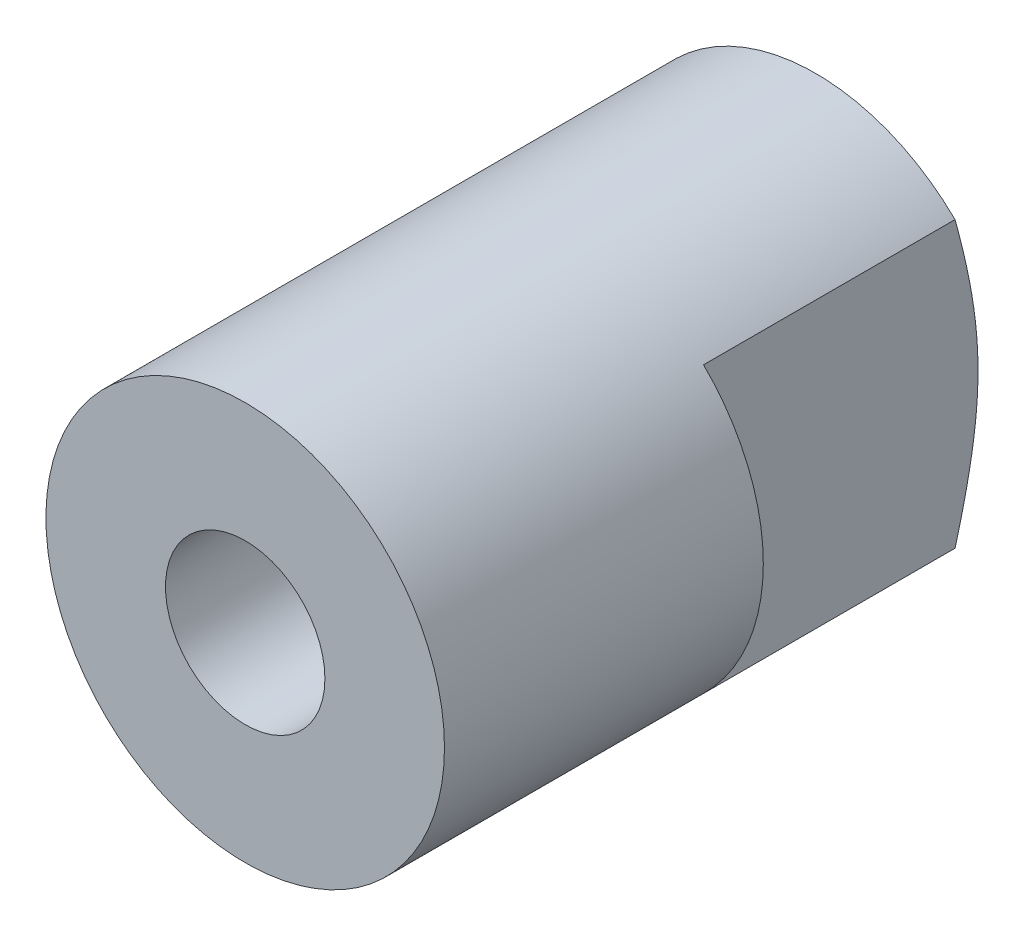
ISO-10303-21;
HEADER;
FILE_DESCRIPTION(('STEP AP214'),'2;1');
FILE_NAME('part.step','',(''),(''),'','','');
FILE_SCHEMA(('AUTOMOTIVE_DESIGN { 1 0 10303 214 1 1 1 1 }'));
ENDSEC;
DATA;
#1=APPLICATION_CONTEXT('core data for automotive mechanical design processes');
#2=APPLICATION_PROTOCOL_DEFINITION('international standard','automotive_design',2000,#1);
#3=PRODUCT_CONTEXT('',#1,'mechanical');
#4=PRODUCT('Part','Part','',(#3));
#5=PRODUCT_RELATED_PRODUCT_CATEGORY('part','',(#4));
#6=PRODUCT_DEFINITION_FORMATION('','',#4);
#7=PRODUCT_DEFINITION_CONTEXT('part definition',#1,'design');
#8=PRODUCT_DEFINITION('design','',#6,#7);
#9=PRODUCT_DEFINITION_SHAPE('','',#8);
#10=(LENGTH_UNIT() NAMED_UNIT(*) SI_UNIT(.MILLI.,.METRE.));
#11=(NAMED_UNIT(*) PLANE_ANGLE_UNIT() SI_UNIT($,.RADIAN.));
#12=(NAMED_UNIT(*) SI_UNIT($,.STERADIAN.) SOLID_ANGLE_UNIT());
#13=UNCERTAINTY_MEASURE_WITH_UNIT(LENGTH_MEASURE(1.E-05),#10,'distance_accuracy_value','');
#14=(GEOMETRIC_REPRESENTATION_CONTEXT(3) GLOBAL_UNCERTAINTY_ASSIGNED_CONTEXT((#13)) GLOBAL_UNIT_ASSIGNED_CONTEXT((#10,
#11,#12)) REPRESENTATION_CONTEXT('',''));
#15=CARTESIAN_POINT('',(0.,0.,0.));
#16=DIRECTION('',(0.,0.,1.));
#17=DIRECTION('',(1.,0.,0.));
#18=AXIS2_PLACEMENT_3D('',#15,#16,#17);
#19=CARTESIAN_POINT('',(0.,0.,8.));
#20=DIRECTION('',(0.,0.,-1.));
#21=DIRECTION('',(-1.,0.,0.));
#22=AXIS2_PLACEMENT_3D('',#19,#20,#21);
#23=CYLINDRICAL_SURFACE('',#22,2.5);
#24=CARTESIAN_POINT('',(0.,0.,8.));
#25=DIRECTION('',(0.,0.,1.));
#26=DIRECTION('',(1.,0.,0.));
#27=AXIS2_PLACEMENT_3D('',#24,#25,#26);
#28=CIRCLE('',#27,2.5);
#29=CARTESIAN_POINT('',(2.5,0.,8.));
#30=VERTEX_POINT('',#29);
#31=EDGE_CURVE('E98',#30,#30,#28,.T.);
#32=ORIENTED_EDGE('',*,*,#31,.F.);
#33=EDGE_LOOP('',(#32));
#34=FACE_BOUND('',#33,.T.);
#35=CARTESIAN_POINT('',(0.,0.,4.));
#36=DIRECTION('',(0.,0.,1.));
#37=DIRECTION('',(1.,0.,0.));
#38=AXIS2_PLACEMENT_3D('',#35,#36,#37);
#39=CIRCLE('',#38,2.5);
#40=CARTESIAN_POINT('',(-1.75,1.78535710713571,4.));
#41=VERTEX_POINT('',#40);
#42=CARTESIAN_POINT('',(-1.75,-1.78535710713571,4.));
#43=VERTEX_POINT('',#42);
#44=EDGE_CURVE('E11',#41,#43,#39,.T.);
#45=ORIENTED_EDGE('',*,*,#44,.T.);
#46=DIRECTION('',(0.,0.,-1.));
#47=VECTOR('',#46,1.);
#48=CARTESIAN_POINT('',(-1.75,-1.78535710713571,8.));
#49=LINE('',#48,#47);
#50=CARTESIAN_POINT('',(-1.75,-1.78535710713572,0.844500877077913));
#51=VERTEX_POINT('',#50);
#52=EDGE_CURVE('E78',#43,#51,#49,.T.);
#53=ORIENTED_EDGE('',*,*,#52,.T.);
#54=CARTESIAN_POINT('',(0.,0.,0.844500877077915));
#55=DIRECTION('',(0.,0.,1.));
#56=DIRECTION('',(1.,0.,0.));
#57=AXIS2_PLACEMENT_3D('',#54,#55,#56);
#58=CIRCLE('',#57,2.5);
#59=CARTESIAN_POINT('',(1.75,-1.78535710713571,0.844500877077915));
#60=VERTEX_POINT('',#59);
#61=EDGE_CURVE('E55',#51,#60,#58,.T.);
#62=ORIENTED_EDGE('',*,*,#61,.T.);
#63=DIRECTION('',(0.,0.,-1.));
#64=VECTOR('',#63,1.);
#65=CARTESIAN_POINT('',(1.75,-1.78535710713571,8.));
#66=LINE('',#65,#64);
#67=CARTESIAN_POINT('',(1.75,-1.78535710713571,4.));
#68=VERTEX_POINT('',#67);
#69=EDGE_CURVE('E93',#68,#60,#66,.T.);
#70=ORIENTED_EDGE('',*,*,#69,.F.);
#71=CARTESIAN_POINT('',(0.,0.,4.));
#72=DIRECTION('',(0.,0.,-1.));
#73=DIRECTION('',(-1.,0.,0.));
#74=AXIS2_PLACEMENT_3D('',#71,#72,#73);
#75=CIRCLE('',#74,2.5);
#76=CARTESIAN_POINT('',(1.75,1.78535710713571,4.));
#77=VERTEX_POINT('',#76);
#78=EDGE_CURVE('E112',#77,#68,#75,.T.);
#79=ORIENTED_EDGE('',*,*,#78,.F.);
#80=DIRECTION('',(0.,0.,-1.));
#81=VECTOR('',#80,1.);
#82=CARTESIAN_POINT('',(1.75,1.78535710713571,8.));
#83=LINE('',#82,#81);
#84=CARTESIAN_POINT('',(1.75,1.78535710713576,0.844500877077879));
#85=VERTEX_POINT('',#84);
#86=EDGE_CURVE('E91',#85,#77,#83,.F.);
#87=ORIENTED_EDGE('',*,*,#86,.F.);
#88=CARTESIAN_POINT('',(-1.75,1.78535710713571,0.844500877077915));
#89=VERTEX_POINT('',#88);
#90=EDGE_CURVE('E83',#85,#89,#58,.T.);
#91=ORIENTED_EDGE('',*,*,#90,.T.);
#92=DIRECTION('',(0.,0.,-1.));
#93=VECTOR('',#92,1.);
#94=CARTESIAN_POINT('',(-1.75,1.78535710713571,8.));
#95=LINE('',#94,#93);
#96=EDGE_CURVE('E47',#89,#41,#95,.F.);
#97=ORIENTED_EDGE('',*,*,#96,.T.);
#98=EDGE_LOOP('',(#45,#53,#62,#70,#79,#87,#91,#97));
#99=FACE_BOUND('',#98,.T.);
#100=ADVANCED_FACE('F30',(#34,#99),#23,.T.);
#101=CARTESIAN_POINT('',(0.,0.,0.844500877077915));
#102=DIRECTION('',(0.,0.,1.));
#103=DIRECTION('',(1.,0.,0.));
#104=AXIS2_PLACEMENT_3D('',#101,#102,#103);
#105=CONICAL_SURFACE('',#104,2.5,1.20427718387609);
#106=CARTESIAN_POINT('',(-1.75,8.19605461493812,3.10192855411082));
#107=CARTESIAN_POINT('',(-1.75,7.93002659032958,3.00207343866155));
#108=CARTESIAN_POINT('',(-1.75,7.66393629305582,2.90238339557051));
#109=CARTESIAN_POINT('',(-1.75,7.13152909729154,2.70349350215407));
#110=CARTESIAN_POINT('',(-1.75,6.86521217175532,2.60429372425121));
#111=CARTESIAN_POINT('',(-1.75,6.33137193220659,2.40621918190581));
#112=CARTESIAN_POINT('',(-1.75,6.0638477130899,2.30734685319689));
#113=CARTESIAN_POINT('',(-1.75,5.52847108782494,2.11060731775616));
#114=CARTESIAN_POINT('',(-1.75,5.26061873113467,2.01273997645805));
#115=CARTESIAN_POINT('',(-1.75,4.69243546413088,1.80690067912252));
#116=CARTESIAN_POINT('',(-1.75,4.3920370562749,1.69911402578876));
#117=CARTESIAN_POINT('',(-1.75,3.94053716748491,1.53977564660928));
#118=CARTESIAN_POINT('',(-1.75,3.78985341019414,1.48704172036875));
#119=CARTESIAN_POINT('',(-1.75,3.48811247809058,1.38265478018666));
#120=CARTESIAN_POINT('',(-1.75,3.33705530662285,1.33100175660126));
#121=CARTESIAN_POINT('',(-1.75,3.03465902882795,1.22926162315679));
#122=CARTESIAN_POINT('',(-1.75,2.88332065846902,1.1791723325718));
#123=CARTESIAN_POINT('',(-1.75,2.57996011632761,1.08111651420444));
#124=CARTESIAN_POINT('',(-1.75,2.42793797405638,1.03314989575896));
#125=CARTESIAN_POINT('',(-1.75,2.1230417120149,0.940373174383529));
#126=CARTESIAN_POINT('',(-1.75,1.97016824885314,0.895560926876658));
#127=CARTESIAN_POINT('',(-1.75,1.66312300043827,0.810668307000652));
#128=CARTESIAN_POINT('',(-1.75,1.5089515654266,0.770586699366417));
#129=CARTESIAN_POINT('',(-1.75,1.27053115325247,0.714595002701888));
#130=CARTESIAN_POINT('',(-1.75,1.18689838143284,0.696075230048017));
#131=CARTESIAN_POINT('',(-1.75,1.01907188491476,0.661723112830771));
#132=CARTESIAN_POINT('',(-1.75,0.934878135532067,0.645890887347907));
#133=CARTESIAN_POINT('',(-1.75,0.766055995920599,0.617568219562072));
#134=CARTESIAN_POINT('',(-1.75,0.681428479661771,0.605072644996745));
#135=CARTESIAN_POINT('',(-1.75,0.511676932068023,0.584049719628205));
#136=CARTESIAN_POINT('',(-1.75,0.426552928809744,0.575522146593431));
#137=CARTESIAN_POINT('',(-1.75,0.257448110399603,0.563099262363324));
#138=CARTESIAN_POINT('',(-1.75,0.173473141587534,0.559126013514574));
#139=CARTESIAN_POINT('',(-1.75,0.00543043052206547,0.555833705929554));
#140=CARTESIAN_POINT('',(-1.75,-0.0786373108317869,0.556514602455115));
#141=CARTESIAN_POINT('',(-1.75,-0.2466606186409,0.562481479130557));
#142=CARTESIAN_POINT('',(-1.75,-0.330616074370712,0.567770499785406));
#143=CARTESIAN_POINT('',(-1.75,-0.498143131702865,0.582586387763705));
#144=CARTESIAN_POINT('',(-1.75,-0.581714741236559,0.592113167121393));
#145=CARTESIAN_POINT('',(-1.75,-0.733132373175893,0.612759165314285));
#146=CARTESIAN_POINT('',(-1.75,-0.801063339165914,0.623269941698058));
#147=CARTESIAN_POINT('',(-1.75,-0.936531411412895,0.646393718582816));
#148=CARTESIAN_POINT('',(-1.75,-1.00406868675859,0.659005735236718));
#149=CARTESIAN_POINT('',(-1.75,-1.13907398495213,0.686065274942139));
#150=CARTESIAN_POINT('',(-1.75,-1.20654045799342,0.700520466121927));
#151=CARTESIAN_POINT('',(-1.75,-1.34114115039655,0.730928054015534));
#152=CARTESIAN_POINT('',(-1.75,-1.40827533017202,0.746880624799369));
#153=CARTESIAN_POINT('',(-1.75,-1.57124831227679,0.787200617761591));
#154=CARTESIAN_POINT('',(-1.75,-1.66692542789498,0.812220029330767));
#155=CARTESIAN_POINT('',(-1.75,-1.85775247370759,0.864201744609191));
#156=CARTESIAN_POINT('',(-1.75,-1.95290236634811,0.891164184851498));
#157=CARTESIAN_POINT('',(-1.75,-2.2377385603586,0.974272015785972));
#158=CARTESIAN_POINT('',(-1.75,-2.42677747428829,1.03262915689346));
#159=CARTESIAN_POINT('',(-1.75,-2.80352246290483,1.15283652769847));
#160=CARTESIAN_POINT('',(-1.75,-2.99122964359447,1.21468334766389));
#161=CARTESIAN_POINT('',(-1.75,-3.36584552392699,1.34065604438694));
#162=CARTESIAN_POINT('',(-1.75,-3.55275433460734,1.40478159183688));
#163=CARTESIAN_POINT('',(-1.75,-3.92377916807999,1.53377959369548));
#164=CARTESIAN_POINT('',(-1.75,-4.10790162296496,1.59863362812462));
#165=CARTESIAN_POINT('',(-1.75,-4.47577214599397,1.72939623513691));
#166=CARTESIAN_POINT('',(-1.75,-4.65952021221368,1.79530481312496));
#167=CARTESIAN_POINT('',(-1.75,-5.21036552649943,1.99416033981976));
#168=CARTESIAN_POINT('',(-1.75,-5.57705546474737,2.12823411737116));
#169=CARTESIAN_POINT('',(-1.75,-6.30986616663053,2.39809297791219));
#170=CARTESIAN_POINT('',(-1.75,-6.67598683473145,2.53387831926635));
#171=CARTESIAN_POINT('',(-1.75,-7.40782604147663,2.80651274381964));
#172=CARTESIAN_POINT('',(-1.75,-7.7735445855157,2.9433618125443));
#173=CARTESIAN_POINT('',(-1.75,-8.50327989620133,3.21722382699157));
#174=CARTESIAN_POINT('',(-1.75,-8.86729769985685,3.35423401242699));
#175=CARTESIAN_POINT('',(-1.75,-9.59515112634909,3.62874221697353));
#176=CARTESIAN_POINT('',(-1.75,-9.95898674836221,3.76624023826768));
#177=CARTESIAN_POINT('',(-1.75,-10.6864305795537,4.04155108727704));
#178=CARTESIAN_POINT('',(-1.75,-11.0500388232724,4.17936382376389));
#179=CARTESIAN_POINT('',(-1.75,-11.777152057885,4.45525555884364));
#180=CARTESIAN_POINT('',(-1.75,-12.1406570493235,4.59333455600137));
#181=CARTESIAN_POINT('',(-1.75,-12.5041270848073,4.73150533152928));
#182=B_SPLINE_CURVE_WITH_KNOTS('',3,(#106,#107,#108,#109,#110,#111,#112,#113,#114,#115,#116,
#117,#118,#119,#120,#121,#122,#123,#124,#125,#126,#127,#128,#129,#130,#131,#132,#133,#134,#135,
#136,#137,#138,#139,#140,#141,#142,#143,#144,#145,#146,#147,#148,#149,#150,#151,#152,#153,#154,
#155,#156,#157,#158,#159,#160,#161,#162,#163,#164,#165,#166,#167,#168,#169,#170,#171,#172,#173,
#174,#175,#176,#177,#178,#179,#180,#181),.UNSPECIFIED.,.F.,.F.,(4,2,2,2,2,2,2,2,2,2,2,2,2,2,2,2,
2,2,2,2,2,2,2,2,2,2,2,2,2,2,2,2,2,2,2,2,2,4),(0.,0.852454220552918,1.70503081270516,
2.56066028897112,3.41617366338804,4.3736131747832,4.85254475358505,5.33147205752065,
5.80969857210265,6.28790464102631,6.76578238514958,7.24353506842087,7.50047769748943,
7.75743170826617,8.0139881789128,8.27053027914937,8.52261339256092,8.77469408281637,
9.02694122551693,9.2791831324127,9.48536497652188,9.69145055165907,9.89842332663478,
10.1054201920145,10.4020738946689,10.6987484629985,11.2922025957381,11.8850865869688,
12.4778852439282,13.0635126402545,13.6491430390835,14.8204306304042,15.9918971996542,
17.163347856196,18.3301922262532,19.4970418244539,20.6635877885952,21.8301274824123),.UNSPECIFIED.);
#183=EDGE_CURVE('E40',#89,#51,#182,.T.);
#184=ORIENTED_EDGE('',*,*,#183,.F.);
#185=ORIENTED_EDGE('',*,*,#90,.F.);
#186=CARTESIAN_POINT('',(1.75,8.19605461493812,3.10192855411082));
#187=CARTESIAN_POINT('',(1.75,7.93002659032958,3.00207343866155));
#188=CARTESIAN_POINT('',(1.75,7.66393629305582,2.90238339557051));
#189=CARTESIAN_POINT('',(1.75,7.13152909729154,2.70349350215407));
#190=CARTESIAN_POINT('',(1.75,6.86521217175532,2.60429372425121));
#191=CARTESIAN_POINT('',(1.75,6.33137193220659,2.40621918190581));
#192=CARTESIAN_POINT('',(1.75,6.0638477130899,2.30734685319689));
#193=CARTESIAN_POINT('',(1.75,5.52847108782494,2.11060731775616));
#194=CARTESIAN_POINT('',(1.75,5.26061873113467,2.01273997645805));
#195=CARTESIAN_POINT('',(1.75,4.69243546413088,1.80690067912252));
#196=CARTESIAN_POINT('',(1.75,4.3920370562749,1.69911402578876));
#197=CARTESIAN_POINT('',(1.75,3.94053716748491,1.53977564660928));
#198=CARTESIAN_POINT('',(1.75,3.78985341019414,1.48704172036875));
#199=CARTESIAN_POINT('',(1.75,3.48811247809058,1.38265478018666));
#200=CARTESIAN_POINT('',(1.75,3.33705530662285,1.33100175660126));
#201=CARTESIAN_POINT('',(1.75,3.03465902882795,1.22926162315679));
#202=CARTESIAN_POINT('',(1.75,2.88332065846902,1.1791723325718));
#203=CARTESIAN_POINT('',(1.75,2.57996011632761,1.08111651420444));
#204=CARTESIAN_POINT('',(1.75,2.42793797405638,1.03314989575896));
#205=CARTESIAN_POINT('',(1.75,2.1230417120149,0.940373174383529));
#206=CARTESIAN_POINT('',(1.75,1.97016824885314,0.895560926876658));
#207=CARTESIAN_POINT('',(1.75,1.66312300043827,0.810668307000652));
#208=CARTESIAN_POINT('',(1.75,1.5089515654266,0.770586699366417));
#209=CARTESIAN_POINT('',(1.75,1.27053115325247,0.714595002701888));
#210=CARTESIAN_POINT('',(1.75,1.18689838143284,0.696075230048017));
#211=CARTESIAN_POINT('',(1.75,1.01907188491476,0.661723112830771));
#212=CARTESIAN_POINT('',(1.75,0.934878135532067,0.645890887347907));
#213=CARTESIAN_POINT('',(1.75,0.766055995920599,0.617568219562072));
#214=CARTESIAN_POINT('',(1.75,0.681428479661771,0.605072644996745));
#215=CARTESIAN_POINT('',(1.75,0.511676932068023,0.584049719628205));
#216=CARTESIAN_POINT('',(1.75,0.426552928809744,0.575522146593431));
#217=CARTESIAN_POINT('',(1.75,0.257448110399603,0.563099262363324));
#218=CARTESIAN_POINT('',(1.75,0.173473141587534,0.559126013514574));
#219=CARTESIAN_POINT('',(1.75,0.00543043052206547,0.555833705929554));
#220=CARTESIAN_POINT('',(1.75,-0.0786373108317869,0.556514602455115));
#221=CARTESIAN_POINT('',(1.75,-0.2466606186409,0.562481479130557));
#222=CARTESIAN_POINT('',(1.75,-0.330616074370712,0.567770499785406));
#223=CARTESIAN_POINT('',(1.75,-0.498143131702865,0.582586387763705));
#224=CARTESIAN_POINT('',(1.75,-0.581714741236559,0.592113167121393));
#225=CARTESIAN_POINT('',(1.75,-0.733132373175893,0.612759165314285));
#226=CARTESIAN_POINT('',(1.75,-0.801063339165914,0.623269941698058));
#227=CARTESIAN_POINT('',(1.75,-0.936531411412895,0.646393718582816));
#228=CARTESIAN_POINT('',(1.75,-1.00406868675859,0.659005735236718));
#229=CARTESIAN_POINT('',(1.75,-1.13907398495213,0.686065274942139));
#230=CARTESIAN_POINT('',(1.75,-1.20654045799342,0.700520466121927));
#231=CARTESIAN_POINT('',(1.75,-1.34114115039655,0.730928054015534));
#232=CARTESIAN_POINT('',(1.75,-1.40827533017202,0.746880624799369));
#233=CARTESIAN_POINT('',(1.75,-1.57124831227679,0.787200617761591));
#234=CARTESIAN_POINT('',(1.75,-1.66692542789498,0.812220029330767));
#235=CARTESIAN_POINT('',(1.75,-1.85775247370759,0.864201744609191));
#236=CARTESIAN_POINT('',(1.75,-1.95290236634811,0.891164184851498));
#237=CARTESIAN_POINT('',(1.75,-2.2377385603586,0.974272015785972));
#238=CARTESIAN_POINT('',(1.75,-2.42677747428829,1.03262915689346));
#239=CARTESIAN_POINT('',(1.75,-2.80352246290483,1.15283652769847));
#240=CARTESIAN_POINT('',(1.75,-2.99122964359447,1.21468334766389));
#241=CARTESIAN_POINT('',(1.75,-3.36584552392699,1.34065604438694));
#242=CARTESIAN_POINT('',(1.75,-3.55275433460734,1.40478159183688));
#243=CARTESIAN_POINT('',(1.75,-3.92377916807999,1.53377959369548));
#244=CARTESIAN_POINT('',(1.75,-4.10790162296496,1.59863362812462));
#245=CARTESIAN_POINT('',(1.75,-4.47577214599397,1.72939623513691));
#246=CARTESIAN_POINT('',(1.75,-4.65952021221368,1.79530481312496));
#247=CARTESIAN_POINT('',(1.75,-5.21036552649943,1.99416033981976));
#248=CARTESIAN_POINT('',(1.75,-5.57705546474737,2.12823411737116));
#249=CARTESIAN_POINT('',(1.75,-6.30986616663053,2.39809297791219));
#250=CARTESIAN_POINT('',(1.75,-6.67598683473145,2.53387831926635));
#251=CARTESIAN_POINT('',(1.75,-7.40782604147663,2.80651274381964));
#252=CARTESIAN_POINT('',(1.75,-7.7735445855157,2.9433618125443));
#253=CARTESIAN_POINT('',(1.75,-8.50327989620133,3.21722382699157));
#254=CARTESIAN_POINT('',(1.75,-8.86729769985685,3.35423401242699));
#255=CARTESIAN_POINT('',(1.75,-9.59515112634909,3.62874221697353));
#256=CARTESIAN_POINT('',(1.75,-9.95898674836221,3.76624023826768));
#257=CARTESIAN_POINT('',(1.75,-10.6864305795537,4.04155108727704));
#258=CARTESIAN_POINT('',(1.75,-11.0500388232724,4.17936382376389));
#259=CARTESIAN_POINT('',(1.75,-11.777152057885,4.45525555884364));
#260=CARTESIAN_POINT('',(1.75,-12.1406570493235,4.59333455600137));
#261=CARTESIAN_POINT('',(1.75,-12.5041270848073,4.73150533152928));
#262=B_SPLINE_CURVE_WITH_KNOTS('',3,(#186,#187,#188,#189,#190,#191,#192,#193,#194,#195,#196,
#197,#198,#199,#200,#201,#202,#203,#204,#205,#206,#207,#208,#209,#210,#211,#212,#213,#214,#215,
#216,#217,#218,#219,#220,#221,#222,#223,#224,#225,#226,#227,#228,#229,#230,#231,#232,#233,#234,
#235,#236,#237,#238,#239,#240,#241,#242,#243,#244,#245,#246,#247,#248,#249,#250,#251,#252,#253,
#254,#255,#256,#257,#258,#259,#260,#261),.UNSPECIFIED.,.F.,.F.,(4,2,2,2,2,2,2,2,2,2,2,2,2,2,2,2,
2,2,2,2,2,2,2,2,2,2,2,2,2,2,2,2,2,2,2,2,2,4),(0.,0.852454220552918,1.70503081270516,
2.56066028897112,3.41617366338804,4.3736131747832,4.85254475358505,5.33147205752065,
5.80969857210265,6.28790464102631,6.76578238514958,7.24353506842087,7.50047769748943,
7.75743170826617,8.0139881789128,8.27053027914937,8.52261339256092,8.77469408281637,
9.02694122551693,9.2791831324127,9.48536497652188,9.69145055165907,9.89842332663478,
10.1054201920145,10.4020738946689,10.6987484629985,11.2922025957381,11.8850865869688,
12.4778852439282,13.0635126402545,13.6491430390835,14.8204306304042,15.9918971996542,
17.163347856196,18.3301922262532,19.4970418244539,20.6635877885952,21.8301274824123),.UNSPECIFIED.);
#263=EDGE_CURVE('E105',#85,#60,#262,.T.);
#264=ORIENTED_EDGE('',*,*,#263,.T.);
#265=ORIENTED_EDGE('',*,*,#61,.F.);
#266=EDGE_LOOP('',(#184,#185,#264,#265));
#267=FACE_BOUND('',#266,.T.);
#268=CARTESIAN_POINT('',(0.,0.,0.));
#269=DIRECTION('',(0.,0.,1.));
#270=DIRECTION('',(1.,0.,0.));
#271=AXIS2_PLACEMENT_3D('',#268,#269,#270);
#272=CIRCLE('',#271,0.299999999999981);
#273=CARTESIAN_POINT('',(0.299999999999981,0.,0.));
#274=VERTEX_POINT('',#273);
#275=EDGE_CURVE('E102',#274,#274,#272,.F.);
#276=ORIENTED_EDGE('',*,*,#275,.F.);
#277=EDGE_LOOP('',(#276));
#278=FACE_BOUND('',#277,.T.);
#279=ADVANCED_FACE('F32',(#267,#278),#105,.T.);
#280=CARTESIAN_POINT('',(0.,0.,8.));
#281=DIRECTION('',(0.,0.,1.));
#282=DIRECTION('',(1.,0.,0.));
#283=AXIS2_PLACEMENT_3D('',#280,#281,#282);
#284=PLANE('',#283);
#285=CARTESIAN_POINT('',(0.,0.,8.));
#286=DIRECTION('',(0.,0.,1.));
#287=DIRECTION('',(1.,0.,0.));
#288=AXIS2_PLACEMENT_3D('',#285,#286,#287);
#289=CIRCLE('',#288,0.999999999999989);
#290=CARTESIAN_POINT('',(0.999999999999989,0.,8.));
#291=VERTEX_POINT('',#290);
#292=EDGE_CURVE('E171',#291,#291,#289,.T.);
#293=ORIENTED_EDGE('',*,*,#292,.F.);
#294=EDGE_LOOP('',(#293));
#295=FACE_BOUND('',#294,.T.);
#296=ORIENTED_EDGE('',*,*,#31,.T.);
#297=EDGE_LOOP('',(#296));
#298=FACE_BOUND('',#297,.T.);
#299=ADVANCED_FACE('F127',(#295,#298),#284,.T.);
#300=CARTESIAN_POINT('',(0.,0.,0.));
#301=DIRECTION('',(0.,0.,1.));
#302=DIRECTION('',(1.,0.,0.));
#303=AXIS2_PLACEMENT_3D('',#300,#301,#302);
#304=PLANE('',#303);
#305=ORIENTED_EDGE('',*,*,#275,.T.);
#306=EDGE_LOOP('',(#305));
#307=FACE_BOUND('',#306,.T.);
#308=CARTESIAN_POINT('',(0.,0.,0.));
#309=DIRECTION('',(0.,0.,-1.));
#310=DIRECTION('',(-1.,0.,0.));
#311=AXIS2_PLACEMENT_3D('',#308,#309,#310);
#312=CIRCLE('',#311,0.25);
#313=CARTESIAN_POINT('',(-0.25,0.,0.));
#314=VERTEX_POINT('',#313);
#315=EDGE_CURVE('E95',#314,#314,#312,.T.);
#316=ORIENTED_EDGE('',*,*,#315,.F.);
#317=EDGE_LOOP('',(#316));
#318=FACE_BOUND('',#317,.T.);
#319=ADVANCED_FACE('F125',(#307,#318),#304,.F.);
#320=CARTESIAN_POINT('',(0.,0.,1.));
#321=DIRECTION('',(0.,0.,-1.));
#322=DIRECTION('',(-1.,0.,0.));
#323=AXIS2_PLACEMENT_3D('',#320,#321,#322);
#324=CYLINDRICAL_SURFACE('',#323,0.25);
#325=CARTESIAN_POINT('',(0.,0.,0.49935453572933));
#326=DIRECTION('',(0.,0.,1.));
#327=DIRECTION('',(1.,0.,0.));
#328=AXIS2_PLACEMENT_3D('',#325,#326,#327);
#329=CIRCLE('',#328,0.25);
#330=CARTESIAN_POINT('',(0.25,0.,0.49935453572933));
#331=VERTEX_POINT('',#330);
#332=EDGE_CURVE('E35',#331,#331,#329,.T.);
#333=ORIENTED_EDGE('',*,*,#332,.T.);
#334=EDGE_LOOP('',(#333));
#335=FACE_BOUND('',#334,.T.);
#336=ORIENTED_EDGE('',*,*,#315,.T.);
#337=EDGE_LOOP('',(#336));
#338=FACE_BOUND('',#337,.T.);
#339=ADVANCED_FACE('F122',(#335,#338),#324,.F.);
#340=CARTESIAN_POINT('',(1.75,5.,4.));
#341=DIRECTION('',(0.,0.,-1.));
#342=DIRECTION('',(-1.,0.,0.));
#343=AXIS2_PLACEMENT_3D('',#340,#341,#342);
#344=PLANE('',#343);
#345=ORIENTED_EDGE('',*,*,#78,.T.);
#346=DIRECTION('',(0.,-1.,0.));
#347=VECTOR('',#346,1.);
#348=CARTESIAN_POINT('',(1.75,5.,4.));
#349=LINE('',#348,#347);
#350=EDGE_CURVE('E85',#77,#68,#349,.T.);
#351=ORIENTED_EDGE('',*,*,#350,.F.);
#352=EDGE_LOOP('',(#345,#351));
#353=FACE_BOUND('',#352,.T.);
#354=ADVANCED_FACE('F119',(#353),#344,.T.);
#355=CARTESIAN_POINT('',(1.75,5.,-1.00718816067653));
#356=DIRECTION('',(1.,0.,0.));
#357=DIRECTION('',(0.,0.,-1.));
#358=AXIS2_PLACEMENT_3D('',#355,#356,#357);
#359=PLANE('',#358);
#360=ORIENTED_EDGE('',*,*,#69,.T.);
#361=ORIENTED_EDGE('',*,*,#263,.F.);
#362=ORIENTED_EDGE('',*,*,#86,.T.);
#363=ORIENTED_EDGE('',*,*,#350,.T.);
#364=EDGE_LOOP('',(#360,#361,#362,#363));
#365=FACE_BOUND('',#364,.T.);
#366=ADVANCED_FACE('F114',(#365),#359,.T.);
#367=CARTESIAN_POINT('',(-1.75,5.,4.));
#368=DIRECTION('',(0.,0.,1.));
#369=DIRECTION('',(1.,0.,0.));
#370=AXIS2_PLACEMENT_3D('',#367,#368,#369);
#371=PLANE('',#370);
#372=DIRECTION('',(0.,-1.,0.));
#373=VECTOR('',#372,1.);
#374=CARTESIAN_POINT('',(-1.75,5.,4.));
#375=LINE('',#374,#373);
#376=EDGE_CURVE('E76',#41,#43,#375,.T.);
#377=ORIENTED_EDGE('',*,*,#376,.T.);
#378=ORIENTED_EDGE('',*,*,#44,.F.);
#379=EDGE_LOOP('',(#377,#378));
#380=FACE_BOUND('',#379,.T.);
#381=ADVANCED_FACE('F75',(#380),#371,.F.);
#382=CARTESIAN_POINT('',(-1.75,5.,-1.00718816067653));
#383=DIRECTION('',(1.,0.,0.));
#384=DIRECTION('',(0.,0.,-1.));
#385=AXIS2_PLACEMENT_3D('',#382,#383,#384);
#386=PLANE('',#385);
#387=ORIENTED_EDGE('',*,*,#376,.F.);
#388=ORIENTED_EDGE('',*,*,#96,.F.);
#389=ORIENTED_EDGE('',*,*,#183,.T.);
#390=ORIENTED_EDGE('',*,*,#52,.F.);
#391=EDGE_LOOP('',(#387,#388,#389,#390));
#392=FACE_BOUND('',#391,.T.);
#393=ADVANCED_FACE('F77',(#392),#386,.F.);
#394=CARTESIAN_POINT('',(0.,0.,0.95));
#395=DIRECTION('',(0.,0.,1.));
#396=DIRECTION('',(1.,0.,0.));
#397=AXIS2_PLACEMENT_3D('',#394,#395,#396);
#398=CONICAL_SURFACE('',#397,0.999999999999998,1.02974425867665);
#399=CARTESIAN_POINT('',(0.,0.,0.95));
#400=DIRECTION('',(0.,0.,1.));
#401=DIRECTION('',(1.,0.,0.));
#402=AXIS2_PLACEMENT_3D('',#399,#400,#401);
#403=CIRCLE('',#402,0.999999999999998);
#404=CARTESIAN_POINT('',(0.999999999999998,0.,0.95));
#405=VERTEX_POINT('',#404);
#406=EDGE_CURVE('E168',#405,#405,#403,.T.);
#407=ORIENTED_EDGE('',*,*,#406,.T.);
#408=EDGE_LOOP('',(#407));
#409=FACE_BOUND('',#408,.T.);
#410=ORIENTED_EDGE('',*,*,#332,.F.);
#411=EDGE_LOOP('',(#410));
#412=FACE_BOUND('',#411,.T.);
#413=ADVANCED_FACE('F154',(#409,#412),#398,.F.);
#414=CARTESIAN_POINT('',(0.,0.,8.));
#415=DIRECTION('',(0.,0.,1.));
#416=DIRECTION('',(1.,0.,0.));
#417=AXIS2_PLACEMENT_3D('',#414,#415,#416);
#418=CYLINDRICAL_SURFACE('',#417,0.999999999999994);
#419=ORIENTED_EDGE('',*,*,#406,.F.);
#420=EDGE_LOOP('',(#419));
#421=FACE_BOUND('',#420,.T.);
#422=ORIENTED_EDGE('',*,*,#292,.T.);
#423=EDGE_LOOP('',(#422));
#424=FACE_BOUND('',#423,.T.);
#425=ADVANCED_FACE('F159',(#421,#424),#418,.F.);
#426=CLOSED_SHELL('',(#100,#279,#299,#319,#339,#354,#366,#381,#393,#413,#425));
#427=MANIFOLD_SOLID_BREP('B2',#426);
#428=ADVANCED_BREP_SHAPE_REPRESENTATION('',(#18,#427),#14);
#429=SHAPE_DEFINITION_REPRESENTATION(#9,#428);
ENDSEC;
END-ISO-10303-21;
